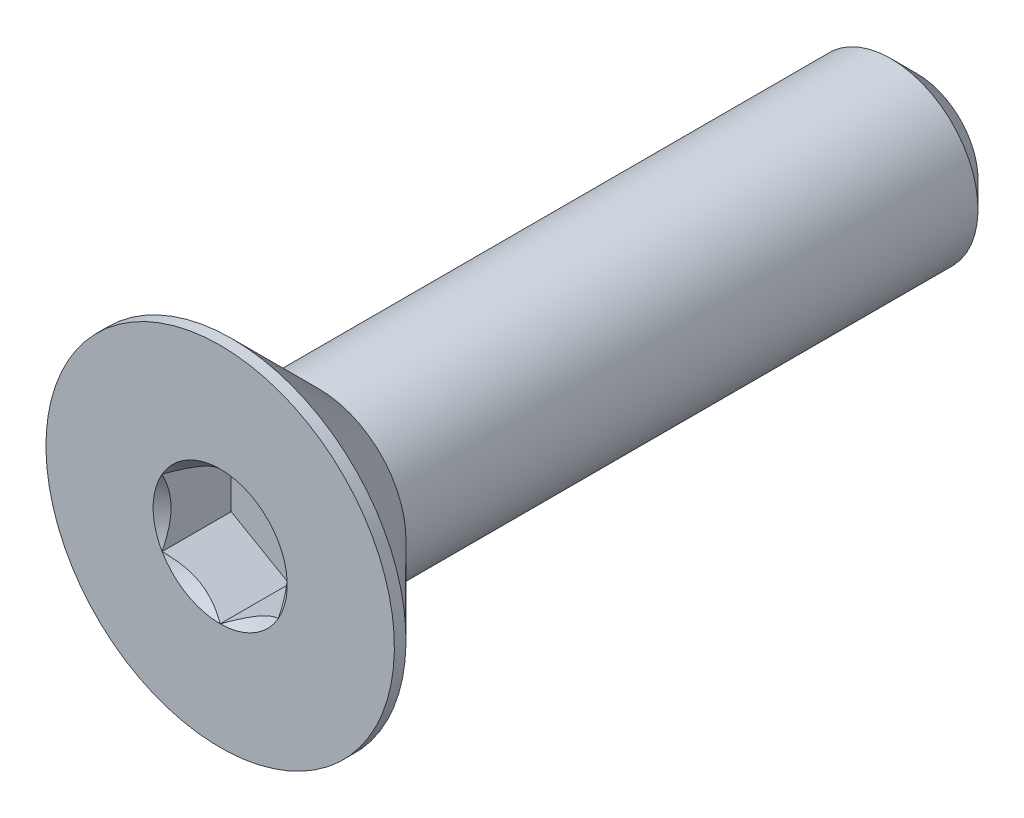
ISO-10303-21;
HEADER;
FILE_DESCRIPTION(('STEP AP214'),'2;1');
FILE_NAME('part.step','',(''),(''),'','','');
FILE_SCHEMA(('AUTOMOTIVE_DESIGN { 1 0 10303 214 1 1 1 1 }'));
ENDSEC;
DATA;
#1=APPLICATION_CONTEXT('core data for automotive mechanical design processes');
#2=APPLICATION_PROTOCOL_DEFINITION('international standard','automotive_design',2000,#1);
#3=PRODUCT_CONTEXT('',#1,'mechanical');
#4=PRODUCT('Part','Part','',(#3));
#5=PRODUCT_RELATED_PRODUCT_CATEGORY('part','',(#4));
#6=PRODUCT_DEFINITION_FORMATION('','',#4);
#7=PRODUCT_DEFINITION_CONTEXT('part definition',#1,'design');
#8=PRODUCT_DEFINITION('design','',#6,#7);
#9=PRODUCT_DEFINITION_SHAPE('','',#8);
#10=(LENGTH_UNIT() NAMED_UNIT(*) SI_UNIT(.MILLI.,.METRE.));
#11=(NAMED_UNIT(*) PLANE_ANGLE_UNIT() SI_UNIT($,.RADIAN.));
#12=(NAMED_UNIT(*) SI_UNIT($,.STERADIAN.) SOLID_ANGLE_UNIT());
#13=UNCERTAINTY_MEASURE_WITH_UNIT(LENGTH_MEASURE(1.E-05),#10,'distance_accuracy_value','');
#14=(GEOMETRIC_REPRESENTATION_CONTEXT(3) GLOBAL_UNCERTAINTY_ASSIGNED_CONTEXT((#13)) GLOBAL_UNIT_ASSIGNED_CONTEXT((#10,
#11,#12)) REPRESENTATION_CONTEXT('',''));
#15=CARTESIAN_POINT('',(0.,0.,0.));
#16=DIRECTION('',(0.,0.,1.));
#17=DIRECTION('',(1.,0.,0.));
#18=AXIS2_PLACEMENT_3D('',#15,#16,#17);
#19=CARTESIAN_POINT('',(0.,0.,-6.));
#20=DIRECTION('',(0.,0.,-1.));
#21=DIRECTION('',(0.,1.,0.));
#22=AXIS2_PLACEMENT_3D('',#19,#20,#21);
#23=CYLINDRICAL_SURFACE('',#22,1.5);
#24=CARTESIAN_POINT('',(0.,0.,4.3));
#25=DIRECTION('',(0.,0.,-1.));
#26=DIRECTION('',(0.,1.,0.));
#27=AXIS2_PLACEMENT_3D('',#24,#25,#26);
#28=CIRCLE('',#27,1.5);
#29=CARTESIAN_POINT('',(0.,1.5,4.3));
#30=VERTEX_POINT('',#29);
#31=EDGE_CURVE('E11',#30,#30,#28,.F.);
#32=ORIENTED_EDGE('',*,*,#31,.F.);
#33=EDGE_LOOP('',(#32));
#34=FACE_BOUND('',#33,.T.);
#35=CARTESIAN_POINT('',(0.,0.,-5.55));
#36=DIRECTION('',(0.,0.,-1.));
#37=DIRECTION('',(0.,1.,0.));
#38=AXIS2_PLACEMENT_3D('',#35,#36,#37);
#39=CIRCLE('',#38,1.5);
#40=CARTESIAN_POINT('',(0.,1.5,-5.55));
#41=VERTEX_POINT('',#40);
#42=EDGE_CURVE('E47',#41,#41,#39,.F.);
#43=ORIENTED_EDGE('',*,*,#42,.T.);
#44=EDGE_LOOP('',(#43));
#45=FACE_BOUND('',#44,.T.);
#46=ADVANCED_FACE('F39',(#34,#45),#23,.T.);
#47=CARTESIAN_POINT('',(0.,1.5,-6.));
#48=DIRECTION('',(0.,0.,-1.));
#49=DIRECTION('',(0.,1.,0.));
#50=AXIS2_PLACEMENT_3D('',#47,#48,#49);
#51=PLANE('',#50);
#52=CARTESIAN_POINT('',(0.,0.,-6.));
#53=DIRECTION('',(0.,0.,-1.));
#54=DIRECTION('',(0.,1.,0.));
#55=AXIS2_PLACEMENT_3D('',#52,#53,#54);
#56=CIRCLE('',#55,1.05);
#57=CARTESIAN_POINT('',(0.,1.05,-6.));
#58=VERTEX_POINT('',#57);
#59=EDGE_CURVE('E151',#58,#58,#56,.T.);
#60=ORIENTED_EDGE('',*,*,#59,.T.);
#61=EDGE_LOOP('',(#60));
#62=FACE_BOUND('',#61,.T.);
#63=ADVANCED_FACE('F160',(#62),#51,.T.);
#64=CARTESIAN_POINT('',(0.,0.,-6.));
#65=DIRECTION('',(0.,0.,1.));
#66=DIRECTION('',(0.,-1.,0.));
#67=AXIS2_PLACEMENT_3D('',#64,#65,#66);
#68=CONICAL_SURFACE('',#67,1.05,0.785398163397447);
#69=ORIENTED_EDGE('',*,*,#42,.F.);
#70=EDGE_LOOP('',(#69));
#71=FACE_BOUND('',#70,.T.);
#72=ORIENTED_EDGE('',*,*,#59,.F.);
#73=EDGE_LOOP('',(#72));
#74=FACE_BOUND('',#73,.T.);
#75=ADVANCED_FACE('F41',(#71,#74),#68,.T.);
#76=CARTESIAN_POINT('',(0.,0.,-6.));
#77=DIRECTION('',(0.,0.,-1.));
#78=DIRECTION('',(0.,1.,0.));
#79=AXIS2_PLACEMENT_3D('',#76,#77,#78);
#80=CYLINDRICAL_SURFACE('',#79,3.);
#81=CARTESIAN_POINT('',(0.,0.,6.));
#82=DIRECTION('',(0.,0.,-1.));
#83=DIRECTION('',(0.,1.,0.));
#84=AXIS2_PLACEMENT_3D('',#81,#82,#83);
#85=CIRCLE('',#84,3.);
#86=CARTESIAN_POINT('',(0.,3.,6.));
#87=VERTEX_POINT('',#86);
#88=EDGE_CURVE('E131',#87,#87,#85,.T.);
#89=ORIENTED_EDGE('',*,*,#88,.T.);
#90=EDGE_LOOP('',(#89));
#91=FACE_BOUND('',#90,.T.);
#92=CARTESIAN_POINT('',(0.,0.,5.8));
#93=DIRECTION('',(0.,0.,-1.));
#94=DIRECTION('',(0.,1.,0.));
#95=AXIS2_PLACEMENT_3D('',#92,#93,#94);
#96=CIRCLE('',#95,3.);
#97=CARTESIAN_POINT('',(0.,3.,5.8));
#98=VERTEX_POINT('',#97);
#99=EDGE_CURVE('E128',#98,#98,#96,.T.);
#100=ORIENTED_EDGE('',*,*,#99,.F.);
#101=EDGE_LOOP('',(#100));
#102=FACE_BOUND('',#101,.T.);
#103=ADVANCED_FACE('F159',(#91,#102),#80,.T.);
#104=CARTESIAN_POINT('',(0.,0.,4.3));
#105=DIRECTION('',(0.,0.,1.));
#106=DIRECTION('',(0.,-1.,0.));
#107=AXIS2_PLACEMENT_3D('',#104,#105,#106);
#108=CONICAL_SURFACE('',#107,1.5,0.785398163397449);
#109=ORIENTED_EDGE('',*,*,#99,.T.);
#110=EDGE_LOOP('',(#109));
#111=FACE_BOUND('',#110,.T.);
#112=ORIENTED_EDGE('',*,*,#31,.T.);
#113=EDGE_LOOP('',(#112));
#114=FACE_BOUND('',#113,.T.);
#115=ADVANCED_FACE('F173',(#111,#114),#108,.T.);
#116=CARTESIAN_POINT('',(0.,0.,6.));
#117=DIRECTION('',(0.,0.,1.));
#118=DIRECTION('',(0.,-1.,0.));
#119=AXIS2_PLACEMENT_3D('',#116,#117,#118);
#120=PLANE('',#119);
#121=CARTESIAN_POINT('',(0.,0.,6.));
#122=DIRECTION('',(0.,0.,1.));
#123=DIRECTION('',(1.,0.,0.));
#124=AXIS2_PLACEMENT_3D('',#121,#122,#123);
#125=CIRCLE('',#124,1.15470053837925);
#126=CARTESIAN_POINT('',(1.,0.577350269189631,6.));
#127=VERTEX_POINT('',#126);
#128=CARTESIAN_POINT('',(0.,1.15470053837926,6.));
#129=VERTEX_POINT('',#128);
#130=EDGE_CURVE('E98',#127,#129,#125,.T.);
#131=ORIENTED_EDGE('',*,*,#130,.F.);
#132=CARTESIAN_POINT('',(0.,0.,6.));
#133=DIRECTION('',(0.,0.,1.));
#134=DIRECTION('',(1.,0.,0.));
#135=AXIS2_PLACEMENT_3D('',#132,#133,#134);
#136=CIRCLE('',#135,1.15470053837925);
#137=CARTESIAN_POINT('',(0.999999999999989,-0.577350269189633,6.));
#138=VERTEX_POINT('',#137);
#139=EDGE_CURVE('E110',#138,#127,#136,.T.);
#140=ORIENTED_EDGE('',*,*,#139,.F.);
#141=CARTESIAN_POINT('',(0.,0.,6.));
#142=DIRECTION('',(0.,0.,1.));
#143=DIRECTION('',(1.,0.,0.));
#144=AXIS2_PLACEMENT_3D('',#141,#142,#143);
#145=CIRCLE('',#144,1.15470053837925);
#146=CARTESIAN_POINT('',(0.,-1.15470053837924,6.));
#147=VERTEX_POINT('',#146);
#148=EDGE_CURVE('E244',#147,#138,#145,.T.);
#149=ORIENTED_EDGE('',*,*,#148,.F.);
#150=CARTESIAN_POINT('',(0.,0.,6.));
#151=DIRECTION('',(0.,0.,1.));
#152=DIRECTION('',(1.,0.,0.));
#153=AXIS2_PLACEMENT_3D('',#150,#151,#152);
#154=CIRCLE('',#153,1.15470053837925);
#155=CARTESIAN_POINT('',(-1.,-0.577350269189613,6.));
#156=VERTEX_POINT('',#155);
#157=EDGE_CURVE('E123',#156,#147,#154,.T.);
#158=ORIENTED_EDGE('',*,*,#157,.F.);
#159=CARTESIAN_POINT('',(0.,0.,6.));
#160=DIRECTION('',(0.,0.,1.));
#161=DIRECTION('',(1.,0.,0.));
#162=AXIS2_PLACEMENT_3D('',#159,#160,#161);
#163=CIRCLE('',#162,1.15470053837925);
#164=CARTESIAN_POINT('',(-1.,0.577350269189624,6.));
#165=VERTEX_POINT('',#164);
#166=EDGE_CURVE('E245',#165,#156,#163,.T.);
#167=ORIENTED_EDGE('',*,*,#166,.F.);
#168=CARTESIAN_POINT('',(0.,0.,6.));
#169=DIRECTION('',(0.,0.,1.));
#170=DIRECTION('',(1.,0.,0.));
#171=AXIS2_PLACEMENT_3D('',#168,#169,#170);
#172=CIRCLE('',#171,1.15470053837925);
#173=EDGE_CURVE('E113',#129,#165,#172,.T.);
#174=ORIENTED_EDGE('',*,*,#173,.F.);
#175=EDGE_LOOP('',(#131,#140,#149,#158,#167,#174));
#176=FACE_BOUND('',#175,.T.);
#177=ORIENTED_EDGE('',*,*,#88,.F.);
#178=EDGE_LOOP('',(#177));
#179=FACE_BOUND('',#178,.T.);
#180=ADVANCED_FACE('F107',(#176,#179),#120,.T.);
#181=CARTESIAN_POINT('',(1.,0.577350269189626,4.81));
#182=DIRECTION('',(0.5,0.866025403784438,0.));
#183=DIRECTION('',(-0.866025403784439,0.5,0.));
#184=AXIS2_PLACEMENT_3D('',#181,#182,#183);
#185=PLANE('',#184);
#186=DIRECTION('',(0.,0.,1.));
#187=VECTOR('',#186,1.);
#188=CARTESIAN_POINT('',(1.,0.577350269189626,4.81));
#189=LINE('',#188,#187);
#190=CARTESIAN_POINT('',(1.,0.577350269189626,4.81));
#191=VERTEX_POINT('',#190);
#192=EDGE_CURVE('E54',#191,#127,#189,.T.);
#193=ORIENTED_EDGE('',*,*,#192,.T.);
#194=CARTESIAN_POINT('',(-0.000199999999999771,1.15481600843309,6.00011548737261));
#195=CARTESIAN_POINT('',(0.0341825950071809,1.13496520795026,5.98027793082573));
#196=CARTESIAN_POINT('',(0.069140118139825,1.11478247255942,5.96160502063888));
#197=CARTESIAN_POINT('',(0.140422802956089,1.07362739529219,5.92741474272315));
#198=CARTESIAN_POINT('',(0.176754750528984,1.0526511355808,5.91191640902345));
#199=CARTESIAN_POINT('',(0.25001661380331,1.01035337909803,5.88536730714226));
#200=CARTESIAN_POINT('',(0.286927851445413,0.989042666109242,5.87424977399692));
#201=CARTESIAN_POINT('',(0.361562729310858,0.945952199282693,5.85711986577618));
#202=CARTESIAN_POINT('',(0.399284088108634,0.924173762626598,5.85109469746667));
#203=CARTESIAN_POINT('',(0.464292198417931,0.886641312640016,5.84566055496749));
#204=CARTESIAN_POINT('',(0.49149437152817,0.870936130672277,5.84485693831673));
#205=CARTESIAN_POINT('',(0.545846040669109,0.83955617986285,5.84620669941688));
#206=CARTESIAN_POINT('',(0.572995523754873,0.823881418494926,5.84836072954719));
#207=CARTESIAN_POINT('',(0.654056277326957,0.777080970599369,5.85911697212847));
#208=CARTESIAN_POINT('',(0.707564140978424,0.746188191116433,5.87201455641535));
#209=CARTESIAN_POINT('',(0.801476065143428,0.691968116419652,5.90314073060217));
#210=CARTESIAN_POINT('',(0.842320523671831,0.668386557293374,5.91973779770184));
#211=CARTESIAN_POINT('',(0.922409637381942,0.622147085933683,5.95712492468529));
#212=CARTESIAN_POINT('',(0.961659010870436,0.599486449584576,5.9779013418174));
#213=CARTESIAN_POINT('',(1.0002,0.577234799135789,6.00011548737261));
#214=B_SPLINE_CURVE_WITH_KNOTS('',3,(#194,#195,#196,#197,#198,#199,#200,#201,#202,#203,#204,
#205,#206,#207,#208,#209,#210,#211,#212,#213),.UNSPECIFIED.,.F.,.F.,(4,2,2,2,2,2,2,2,2,4),(0.,
0.133237676828559,0.267252229834489,0.399137076269298,0.530689603280766,0.624814864263843,
0.718960890149129,0.907306626112092,1.05710100361789,1.20641411519286),.UNSPECIFIED.);
#215=EDGE_CURVE('E95',#129,#127,#214,.T.);
#216=ORIENTED_EDGE('',*,*,#215,.F.);
#217=DIRECTION('',(0.,0.,1.));
#218=VECTOR('',#217,1.);
#219=CARTESIAN_POINT('',(0.,1.15470053837925,4.81));
#220=LINE('',#219,#218);
#221=CARTESIAN_POINT('',(0.,1.15470053837925,4.81));
#222=VERTEX_POINT('',#221);
#223=EDGE_CURVE('E147',#222,#129,#220,.T.);
#224=ORIENTED_EDGE('',*,*,#223,.F.);
#225=DIRECTION('',(-0.866025403784439,0.5,0.));
#226=VECTOR('',#225,1.);
#227=CARTESIAN_POINT('',(1.,0.577350269189626,4.81));
#228=LINE('',#227,#226);
#229=EDGE_CURVE('E120',#191,#222,#228,.T.);
#230=ORIENTED_EDGE('',*,*,#229,.F.);
#231=EDGE_LOOP('',(#193,#216,#224,#230));
#232=FACE_BOUND('',#231,.T.);
#233=ADVANCED_FACE('F125',(#232),#185,.F.);
#234=CARTESIAN_POINT('',(1.,-0.577350269189627,4.81));
#235=DIRECTION('',(1.,0.,0.));
#236=DIRECTION('',(0.,0.,-1.));
#237=AXIS2_PLACEMENT_3D('',#234,#235,#236);
#238=PLANE('',#237);
#239=DIRECTION('',(0.,0.,1.));
#240=VECTOR('',#239,1.);
#241=CARTESIAN_POINT('',(1.,-0.577350269189627,4.81));
#242=LINE('',#241,#240);
#243=CARTESIAN_POINT('',(1.,-0.577350269189627,4.81));
#244=VERTEX_POINT('',#243);
#245=EDGE_CURVE('E62',#244,#138,#242,.T.);
#246=ORIENTED_EDGE('',*,*,#245,.T.);
#247=CARTESIAN_POINT('',(1.,-1.15147208646462,6.37038567751387));
#248=CARTESIAN_POINT('',(1.,-1.12343447988553,6.34921991987372));
#249=CARTESIAN_POINT('',(1.,-1.09524064850698,6.32826169217592));
#250=CARTESIAN_POINT('',(1.,-1.03847715644377,6.28684602223563));
#251=CARTESIAN_POINT('',(1.,-1.00990740382976,6.26638870612367));
#252=CARTESIAN_POINT('',(1.,-0.923120894333481,6.20560479495452));
#253=CARTESIAN_POINT('',(1.,-0.864253173759063,6.16619222896141));
#254=CARTESIAN_POINT('',(1.,-0.740809858258048,6.08882066420021));
#255=CARTESIAN_POINT('',(1.,-0.676100255137808,6.05107303911435));
#256=CARTESIAN_POINT('',(1.,-0.543448939049124,5.9820245875513));
#257=CARTESIAN_POINT('',(1.,-0.475519112027778,5.95070202784687));
#258=CARTESIAN_POINT('',(1.,-0.373555850333527,5.9123817788838));
#259=CARTESIAN_POINT('',(1.,-0.341031989670906,5.90138359164216));
#260=CARTESIAN_POINT('',(1.,-0.27519907905229,5.88199834214736));
#261=CARTESIAN_POINT('',(1.,-0.24188997517393,5.8736114597767));
#262=CARTESIAN_POINT('',(1.,-0.175247517042989,5.86002522071902));
#263=CARTESIAN_POINT('',(1.,-0.141925568218171,5.85477079076797));
#264=CARTESIAN_POINT('',(1.,-0.0749144362322751,5.84754868657089));
#265=CARTESIAN_POINT('',(1.,-0.0412251978501576,5.84558151361051));
#266=CARTESIAN_POINT('',(1.,0.0249580992634257,5.84508319839316));
#267=CARTESIAN_POINT('',(1.,0.0574512826460443,5.84643026788863));
#268=CARTESIAN_POINT('',(1.,0.122148505701872,5.85221648449898));
#269=CARTESIAN_POINT('',(1.,0.154352610132932,5.85665492066154));
#270=CARTESIAN_POINT('',(1.,0.218799898867646,5.8684568301452));
#271=CARTESIAN_POINT('',(1.,0.25103374326896,5.87587054103851));
#272=CARTESIAN_POINT('',(1.,0.314797132354925,5.89322894249868));
#273=CARTESIAN_POINT('',(1.,0.346326735731011,5.90317342128883));
#274=CARTESIAN_POINT('',(1.,0.445594187730212,5.93822348255434));
#275=CARTESIAN_POINT('',(1.,0.511919139476043,5.96732085835672));
#276=CARTESIAN_POINT('',(1.,0.641453244657538,6.0320153296865));
#277=CARTESIAN_POINT('',(1.,0.70465013312635,6.06763577671524));
#278=CARTESIAN_POINT('',(1.,0.825428490174992,6.14112390134693));
#279=CARTESIAN_POINT('',(1.,0.88313294786769,6.17879194713546));
#280=CARTESIAN_POINT('',(1.,0.96814885370457,6.23702285294316));
#281=CARTESIAN_POINT('',(1.,0.996120570380289,6.25663847576285));
#282=CARTESIAN_POINT('',(1.,1.05168177729902,6.29638851706127));
#283=CARTESIAN_POINT('',(1.,1.07927136997701,6.31652279219883));
#284=CARTESIAN_POINT('',(1.,1.1067018534633,6.33687211907297));
#285=B_SPLINE_CURVE_WITH_KNOTS('',3,(#247,#248,#249,#250,#251,#252,#253,#254,#255,#256,#257,
#258,#259,#260,#261,#262,#263,#264,#265,#266,#267,#268,#269,#270,#271,#272,#273,#274,#275,#276,
#277,#278,#279,#280,#281,#282,#283,#284),.UNSPECIFIED.,.F.,.F.,(4,2,2,2,2,2,2,2,2,2,2,2,2,2,2,2,
2,2,4),(0.,0.105386459083292,0.210799187330127,0.423233611565474,0.647793540908512,
0.871580877738622,0.974493074181434,1.07741235827203,1.17846428203206,1.27953161415764,
1.37694086739612,1.47432772585409,1.57343322804295,1.67253043972853,1.88917353996829,
2.10660791038814,2.31323734249845,2.41572589232046,2.51818641476504),.UNSPECIFIED.);
#286=EDGE_CURVE('E119',#127,#138,#285,.F.);
#287=ORIENTED_EDGE('',*,*,#286,.F.);
#288=ORIENTED_EDGE('',*,*,#192,.F.);
#289=DIRECTION('',(0.,1.,0.));
#290=VECTOR('',#289,1.);
#291=CARTESIAN_POINT('',(1.,-0.577350269189627,4.81));
#292=LINE('',#291,#290);
#293=EDGE_CURVE('E136',#244,#191,#292,.T.);
#294=ORIENTED_EDGE('',*,*,#293,.F.);
#295=EDGE_LOOP('',(#246,#287,#288,#294));
#296=FACE_BOUND('',#295,.T.);
#297=ADVANCED_FACE('F122',(#296),#238,.F.);
#298=CARTESIAN_POINT('',(0.,-1.15470053837925,4.81));
#299=DIRECTION('',(0.5,-0.866025403784439,0.));
#300=DIRECTION('',(0.866025403784439,0.5,0.));
#301=AXIS2_PLACEMENT_3D('',#298,#299,#300);
#302=PLANE('',#301);
#303=DIRECTION('',(0.,0.,1.));
#304=VECTOR('',#303,1.);
#305=CARTESIAN_POINT('',(0.,-1.15470053837925,4.81));
#306=LINE('',#305,#304);
#307=CARTESIAN_POINT('',(0.,-1.15470053837925,4.81));
#308=VERTEX_POINT('',#307);
#309=EDGE_CURVE('E133',#308,#147,#306,.T.);
#310=ORIENTED_EDGE('',*,*,#309,.T.);
#311=CARTESIAN_POINT('',(1.0002,-0.577234799135789,6.00011548737262));
#312=CARTESIAN_POINT('',(0.965817404992819,-0.597085599618622,5.98027793082574));
#313=CARTESIAN_POINT('',(0.930859881860175,-0.617268335009457,5.9616050206389));
#314=CARTESIAN_POINT('',(0.859577197043911,-0.658423412276686,5.92741474272317));
#315=CARTESIAN_POINT('',(0.823245249471016,-0.67939967198808,5.91191640902347));
#316=CARTESIAN_POINT('',(0.74998338619669,-0.721697428470846,5.88536730714227));
#317=CARTESIAN_POINT('',(0.713072148554587,-0.743008141459636,5.87424977399693));
#318=CARTESIAN_POINT('',(0.638437270689143,-0.786098608286185,5.85711986577619));
#319=CARTESIAN_POINT('',(0.600715911891367,-0.80787704494228,5.85109469746668));
#320=CARTESIAN_POINT('',(0.535707801582069,-0.845409494928862,5.8456605549675));
#321=CARTESIAN_POINT('',(0.50850562847183,-0.861114676896601,5.84485693831674));
#322=CARTESIAN_POINT('',(0.45415395933089,-0.892494627706028,5.8462066994169));
#323=CARTESIAN_POINT('',(0.427004476245126,-0.908169389073953,5.84836072954721));
#324=CARTESIAN_POINT('',(0.345943722673041,-0.95496983696951,5.85911697212848));
#325=CARTESIAN_POINT('',(0.292435859021574,-0.985862616452447,5.87201455641537));
#326=CARTESIAN_POINT('',(0.198523934856569,-1.04008269114923,5.90314073060219));
#327=CARTESIAN_POINT('',(0.157679476328166,-1.06366425027551,5.91973779770185));
#328=CARTESIAN_POINT('',(0.0775903626180564,-1.1099037216352,5.9571249246853));
#329=CARTESIAN_POINT('',(0.0383409891295622,-1.1325643579843,5.97790134181741));
#330=CARTESIAN_POINT('',(-0.000199999999999974,-1.15481600843309,6.00011548737262));
#331=B_SPLINE_CURVE_WITH_KNOTS('',3,(#311,#312,#313,#314,#315,#316,#317,#318,#319,#320,#321,
#322,#323,#324,#325,#326,#327,#328,#329,#330),.UNSPECIFIED.,.F.,.F.,(4,2,2,2,2,2,2,2,2,4),(0.,
0.133237676828558,0.267252229834488,0.399137076269296,0.530689603280763,0.624814864263842,
0.718960890149129,0.907306626112095,1.05710100361789,1.20641411519286),.UNSPECIFIED.);
#332=EDGE_CURVE('E242',#138,#147,#331,.T.);
#333=ORIENTED_EDGE('',*,*,#332,.F.);
#334=ORIENTED_EDGE('',*,*,#245,.F.);
#335=DIRECTION('',(0.866025403784439,0.5,0.));
#336=VECTOR('',#335,1.);
#337=CARTESIAN_POINT('',(0.,-1.15470053837925,4.81));
#338=LINE('',#337,#336);
#339=EDGE_CURVE('E234',#308,#244,#338,.T.);
#340=ORIENTED_EDGE('',*,*,#339,.F.);
#341=EDGE_LOOP('',(#310,#333,#334,#340));
#342=FACE_BOUND('',#341,.T.);
#343=ADVANCED_FACE('F199',(#342),#302,.F.);
#344=CARTESIAN_POINT('',(-1.,-0.577350269189626,4.81));
#345=DIRECTION('',(-0.5,-0.866025403784439,0.));
#346=DIRECTION('',(0.866025403784439,-0.5,0.));
#347=AXIS2_PLACEMENT_3D('',#344,#345,#346);
#348=PLANE('',#347);
#349=DIRECTION('',(0.,0.,1.));
#350=VECTOR('',#349,1.);
#351=CARTESIAN_POINT('',(-1.,-0.577350269189626,4.81));
#352=LINE('',#351,#350);
#353=CARTESIAN_POINT('',(-1.,-0.577350269189626,4.81));
#354=VERTEX_POINT('',#353);
#355=EDGE_CURVE('E141',#354,#156,#352,.T.);
#356=ORIENTED_EDGE('',*,*,#355,.T.);
#357=CARTESIAN_POINT('',(0.000199999999999887,-1.15481600843309,6.00011548737262));
#358=CARTESIAN_POINT('',(-0.0341825950071809,-1.13496520795026,5.98027793082574));
#359=CARTESIAN_POINT('',(-0.0691401181398252,-1.11478247255942,5.9616050206389));
#360=CARTESIAN_POINT('',(-0.14042280295609,-1.07362739529219,5.92741474272317));
#361=CARTESIAN_POINT('',(-0.176754750528985,-1.0526511355808,5.91191640902347));
#362=CARTESIAN_POINT('',(-0.250016613803312,-1.01035337909803,5.88536730714227));
#363=CARTESIAN_POINT('',(-0.286927851445416,-0.98904266610924,5.87424977399694));
#364=CARTESIAN_POINT('',(-0.361562729310861,-0.94595219928269,5.85711986577619));
#365=CARTESIAN_POINT('',(-0.399284088108638,-0.924173762626595,5.85109469746668));
#366=CARTESIAN_POINT('',(-0.464292198417936,-0.886641312640013,5.8456605549675));
#367=CARTESIAN_POINT('',(-0.491494371528175,-0.870936130672274,5.84485693831674));
#368=CARTESIAN_POINT('',(-0.545846040669115,-0.839556179862847,5.8462066994169));
#369=CARTESIAN_POINT('',(-0.572995523754879,-0.823881418494922,5.84836072954721));
#370=CARTESIAN_POINT('',(-0.654056277326964,-0.777080970599364,5.85911697212848));
#371=CARTESIAN_POINT('',(-0.707564140978432,-0.746188191116428,5.87201455641537));
#372=CARTESIAN_POINT('',(-0.801476065143435,-0.691968116419647,5.90314073060219));
#373=CARTESIAN_POINT('',(-0.842320523671837,-0.66838655729337,5.91973779770185));
#374=CARTESIAN_POINT('',(-0.922409637381945,-0.622147085933681,5.9571249246853));
#375=CARTESIAN_POINT('',(-0.961659010870438,-0.599486449584575,5.97790134181741));
#376=CARTESIAN_POINT('',(-1.0002,-0.577234799135788,6.00011548737262));
#377=B_SPLINE_CURVE_WITH_KNOTS('',3,(#357,#358,#359,#360,#361,#362,#363,#364,#365,#366,#367,
#368,#369,#370,#371,#372,#373,#374,#375,#376),.UNSPECIFIED.,.F.,.F.,(4,2,2,2,2,2,2,2,2,4),(0.,
0.13323767682856,0.267252229834492,0.399137076269302,0.530689603280771,0.624814864263849,
0.718960890149137,0.907306626112103,1.0571010036179,1.20641411519286),.UNSPECIFIED.);
#378=EDGE_CURVE('E216',#147,#156,#377,.T.);
#379=ORIENTED_EDGE('',*,*,#378,.F.);
#380=ORIENTED_EDGE('',*,*,#309,.F.);
#381=DIRECTION('',(0.866025403784439,-0.5,0.));
#382=VECTOR('',#381,1.);
#383=CARTESIAN_POINT('',(-1.,-0.577350269189626,4.81));
#384=LINE('',#383,#382);
#385=EDGE_CURVE('E232',#354,#308,#384,.T.);
#386=ORIENTED_EDGE('',*,*,#385,.F.);
#387=EDGE_LOOP('',(#356,#379,#380,#386));
#388=FACE_BOUND('',#387,.T.);
#389=ADVANCED_FACE('F195',(#388),#348,.F.);
#390=CARTESIAN_POINT('',(-1.,0.577350269189626,4.81));
#391=DIRECTION('',(-1.,0.,0.));
#392=DIRECTION('',(0.,-1.,0.));
#393=AXIS2_PLACEMENT_3D('',#390,#391,#392);
#394=PLANE('',#393);
#395=DIRECTION('',(0.,0.,1.));
#396=VECTOR('',#395,1.);
#397=CARTESIAN_POINT('',(-1.,0.577350269189626,4.81));
#398=LINE('',#397,#396);
#399=CARTESIAN_POINT('',(-1.,0.577350269189626,4.81));
#400=VERTEX_POINT('',#399);
#401=EDGE_CURVE('E144',#400,#165,#398,.T.);
#402=ORIENTED_EDGE('',*,*,#401,.T.);
#403=CARTESIAN_POINT('',(-1.,-1.15147208646462,6.37038567751387));
#404=CARTESIAN_POINT('',(-1.,-1.12343447988552,6.34921991987372));
#405=CARTESIAN_POINT('',(-1.,-1.09524064850698,6.32826169217592));
#406=CARTESIAN_POINT('',(-1.,-1.03847715644377,6.28684602223563));
#407=CARTESIAN_POINT('',(-1.,-1.00990740382975,6.26638870612367));
#408=CARTESIAN_POINT('',(-1.,-0.923120894333481,6.20560479495452));
#409=CARTESIAN_POINT('',(-1.,-0.864253173759063,6.16619222896141));
#410=CARTESIAN_POINT('',(-1.,-0.740809858258048,6.08882066420021));
#411=CARTESIAN_POINT('',(-1.,-0.676100255137808,6.05107303911435));
#412=CARTESIAN_POINT('',(-1.,-0.543448939049123,5.9820245875513));
#413=CARTESIAN_POINT('',(-1.,-0.475519112027777,5.95070202784687));
#414=CARTESIAN_POINT('',(-1.,-0.373555850333526,5.9123817788838));
#415=CARTESIAN_POINT('',(-1.,-0.341031989670905,5.90138359164216));
#416=CARTESIAN_POINT('',(-1.,-0.27519907905229,5.88199834214736));
#417=CARTESIAN_POINT('',(-1.,-0.241889975173929,5.8736114597767));
#418=CARTESIAN_POINT('',(-1.,-0.175247517042988,5.86002522071902));
#419=CARTESIAN_POINT('',(-1.,-0.141925568218171,5.85477079076797));
#420=CARTESIAN_POINT('',(-1.,-0.0749144362322744,5.84754868657089));
#421=CARTESIAN_POINT('',(-1.,-0.0412251978501569,5.84558151361051));
#422=CARTESIAN_POINT('',(-1.,0.0249580992634262,5.84508319839316));
#423=CARTESIAN_POINT('',(-1.,0.0574512826460446,5.84643026788864));
#424=CARTESIAN_POINT('',(-1.,0.122148505701872,5.85221648449899));
#425=CARTESIAN_POINT('',(-1.,0.154352610132932,5.85665492066154));
#426=CARTESIAN_POINT('',(-1.,0.218799898867646,5.8684568301452));
#427=CARTESIAN_POINT('',(-1.,0.25103374326896,5.87587054103851));
#428=CARTESIAN_POINT('',(-1.,0.314797132354926,5.89322894249868));
#429=CARTESIAN_POINT('',(-1.,0.346326735731011,5.90317342128883));
#430=CARTESIAN_POINT('',(-1.,0.445594187730212,5.93822348255434));
#431=CARTESIAN_POINT('',(-1.,0.511919139476043,5.96732085835673));
#432=CARTESIAN_POINT('',(-1.,0.641453244657539,6.0320153296865));
#433=CARTESIAN_POINT('',(-1.,0.704650133126351,6.06763577671524));
#434=CARTESIAN_POINT('',(-1.,0.825428490174992,6.14112390134694));
#435=CARTESIAN_POINT('',(-1.,0.883132947867691,6.17879194713546));
#436=CARTESIAN_POINT('',(-1.,0.968148853704571,6.23702285294316));
#437=CARTESIAN_POINT('',(-1.,0.99612057038029,6.25663847576286));
#438=CARTESIAN_POINT('',(-1.,1.05168177729902,6.29638851706127));
#439=CARTESIAN_POINT('',(-1.,1.07927136997701,6.31652279219883));
#440=CARTESIAN_POINT('',(-1.,1.1067018534633,6.33687211907297));
#441=B_SPLINE_CURVE_WITH_KNOTS('',3,(#403,#404,#405,#406,#407,#408,#409,#410,#411,#412,#413,
#414,#415,#416,#417,#418,#419,#420,#421,#422,#423,#424,#425,#426,#427,#428,#429,#430,#431,#432,
#433,#434,#435,#436,#437,#438,#439,#440),.UNSPECIFIED.,.F.,.F.,(4,2,2,2,2,2,2,2,2,2,2,2,2,2,2,2,
2,2,4),(0.,0.105386459083291,0.210799187330127,0.423233611565474,0.647793540908512,
0.871580877738622,0.974493074181434,1.07741235827203,1.17846428203206,1.27953161415764,
1.37694086739612,1.47432772585409,1.57343322804295,1.67253043972853,1.88917353996829,
2.10660791038815,2.31323734249845,2.41572589232046,2.51818641476504),.UNSPECIFIED.);
#442=EDGE_CURVE('E101',#156,#165,#441,.T.);
#443=ORIENTED_EDGE('',*,*,#442,.F.);
#444=ORIENTED_EDGE('',*,*,#355,.F.);
#445=DIRECTION('',(0.,-1.,0.));
#446=VECTOR('',#445,1.);
#447=CARTESIAN_POINT('',(-1.,0.577350269189626,4.81));
#448=LINE('',#447,#446);
#449=EDGE_CURVE('E229',#400,#354,#448,.T.);
#450=ORIENTED_EDGE('',*,*,#449,.F.);
#451=EDGE_LOOP('',(#402,#443,#444,#450));
#452=FACE_BOUND('',#451,.T.);
#453=ADVANCED_FACE('F191',(#452),#394,.F.);
#454=CARTESIAN_POINT('',(0.,1.15470053837925,4.81));
#455=DIRECTION('',(-0.5,0.866025403784439,0.));
#456=DIRECTION('',(-0.866025403784439,-0.5,0.));
#457=AXIS2_PLACEMENT_3D('',#454,#455,#456);
#458=PLANE('',#457);
#459=ORIENTED_EDGE('',*,*,#223,.T.);
#460=CARTESIAN_POINT('',(-1.0002,0.577234799135788,6.00011548737261));
#461=CARTESIAN_POINT('',(-0.965817404992819,0.597085599618622,5.98027793082573));
#462=CARTESIAN_POINT('',(-0.930859881860174,0.617268335009457,5.96160502063889));
#463=CARTESIAN_POINT('',(-0.859577197043909,0.658423412276687,5.92741474272315));
#464=CARTESIAN_POINT('',(-0.823245249471015,0.679399671988081,5.91191640902345));
#465=CARTESIAN_POINT('',(-0.749983386196687,0.721697428470848,5.88536730714226));
#466=CARTESIAN_POINT('',(-0.713072148554583,0.743008141459638,5.87424977399692));
#467=CARTESIAN_POINT('',(-0.638437270689138,0.786098608286188,5.85711986577618));
#468=CARTESIAN_POINT('',(-0.600715911891361,0.807877044942283,5.85109469746667));
#469=CARTESIAN_POINT('',(-0.535707801582063,0.845409494928865,5.84566055496749));
#470=CARTESIAN_POINT('',(-0.508505628471824,0.861114676896604,5.84485693831673));
#471=CARTESIAN_POINT('',(-0.454153959330885,0.892494627706031,5.84620669941688));
#472=CARTESIAN_POINT('',(-0.427004476245121,0.908169389073956,5.84836072954719));
#473=CARTESIAN_POINT('',(-0.345943722673037,0.954969836969513,5.85911697212847));
#474=CARTESIAN_POINT('',(-0.29243585902157,0.985862616452449,5.87201455641535));
#475=CARTESIAN_POINT('',(-0.198523934856567,1.04008269114923,5.90314073060217));
#476=CARTESIAN_POINT('',(-0.157679476328164,1.06366425027551,5.91973779770183));
#477=CARTESIAN_POINT('',(-0.0775903626180557,1.1099037216352,5.95712492468529));
#478=CARTESIAN_POINT('',(-0.038340989129562,1.1325643579843,5.9779013418174));
#479=CARTESIAN_POINT('',(0.000200000000000015,1.15481600843309,6.00011548737261));
#480=B_SPLINE_CURVE_WITH_KNOTS('',3,(#460,#461,#462,#463,#464,#465,#466,#467,#468,#469,#470,
#471,#472,#473,#474,#475,#476,#477,#478,#479),.UNSPECIFIED.,.F.,.F.,(4,2,2,2,2,2,2,2,2,4),(0.,
0.133237676828561,0.267252229834493,0.399137076269304,0.530689603280773,0.624814864263851,
0.718960890149137,0.907306626112101,1.0571010036179,1.20641411519286),.UNSPECIFIED.);
#481=EDGE_CURVE('E238',#165,#129,#480,.T.);
#482=ORIENTED_EDGE('',*,*,#481,.F.);
#483=ORIENTED_EDGE('',*,*,#401,.F.);
#484=DIRECTION('',(-0.866025403784439,-0.5,0.));
#485=VECTOR('',#484,1.);
#486=CARTESIAN_POINT('',(0.,1.15470053837925,4.81));
#487=LINE('',#486,#485);
#488=EDGE_CURVE('E226',#222,#400,#487,.T.);
#489=ORIENTED_EDGE('',*,*,#488,.F.);
#490=EDGE_LOOP('',(#459,#482,#483,#489));
#491=FACE_BOUND('',#490,.T.);
#492=ADVANCED_FACE('F187',(#491),#458,.F.);
#493=CARTESIAN_POINT('',(0.,0.,4.81));
#494=DIRECTION('',(0.,0.,1.));
#495=DIRECTION('',(1.,0.,0.));
#496=AXIS2_PLACEMENT_3D('',#493,#494,#495);
#497=PLANE('',#496);
#498=ORIENTED_EDGE('',*,*,#229,.T.);
#499=ORIENTED_EDGE('',*,*,#488,.T.);
#500=ORIENTED_EDGE('',*,*,#449,.T.);
#501=ORIENTED_EDGE('',*,*,#385,.T.);
#502=ORIENTED_EDGE('',*,*,#339,.T.);
#503=ORIENTED_EDGE('',*,*,#293,.T.);
#504=EDGE_LOOP('',(#498,#499,#500,#501,#502,#503));
#505=FACE_BOUND('',#504,.T.);
#506=ADVANCED_FACE('F190',(#505),#497,.T.);
#507=CARTESIAN_POINT('',(0.,0.,6.));
#508=DIRECTION('',(0.,0.,1.));
#509=DIRECTION('',(1.,0.,0.));
#510=AXIS2_PLACEMENT_3D('',#507,#508,#509);
#511=CONICAL_SURFACE('',#510,1.15470053837925,0.78539816339745);
#512=ORIENTED_EDGE('',*,*,#481,.T.);
#513=ORIENTED_EDGE('',*,*,#173,.T.);
#514=EDGE_LOOP('',(#512,#513));
#515=FACE_BOUND('',#514,.T.);
#516=ADVANCED_FACE('F206',(#515),#511,.F.);
#517=CARTESIAN_POINT('',(0.,0.,6.));
#518=DIRECTION('',(0.,0.,1.));
#519=DIRECTION('',(1.,0.,0.));
#520=AXIS2_PLACEMENT_3D('',#517,#518,#519);
#521=CONICAL_SURFACE('',#520,1.15470053837925,0.78539816339745);
#522=ORIENTED_EDGE('',*,*,#378,.T.);
#523=ORIENTED_EDGE('',*,*,#157,.T.);
#524=EDGE_LOOP('',(#522,#523));
#525=FACE_BOUND('',#524,.T.);
#526=ADVANCED_FACE('F208',(#525),#521,.F.);
#527=CARTESIAN_POINT('',(0.,0.,6.));
#528=DIRECTION('',(0.,0.,1.));
#529=DIRECTION('',(1.,0.,0.));
#530=AXIS2_PLACEMENT_3D('',#527,#528,#529);
#531=CONICAL_SURFACE('',#530,1.15470053837925,0.78539816339745);
#532=ORIENTED_EDGE('',*,*,#286,.T.);
#533=ORIENTED_EDGE('',*,*,#139,.T.);
#534=EDGE_LOOP('',(#532,#533));
#535=FACE_BOUND('',#534,.T.);
#536=ADVANCED_FACE('F118',(#535),#531,.F.);
#537=CARTESIAN_POINT('',(0.,0.,6.));
#538=DIRECTION('',(0.,0.,1.));
#539=DIRECTION('',(1.,0.,0.));
#540=AXIS2_PLACEMENT_3D('',#537,#538,#539);
#541=CONICAL_SURFACE('',#540,1.15470053837925,0.78539816339745);
#542=ORIENTED_EDGE('',*,*,#332,.T.);
#543=ORIENTED_EDGE('',*,*,#148,.T.);
#544=EDGE_LOOP('',(#542,#543));
#545=FACE_BOUND('',#544,.T.);
#546=ADVANCED_FACE('F257',(#545),#541,.F.);
#547=CARTESIAN_POINT('',(0.,0.,6.));
#548=DIRECTION('',(0.,0.,1.));
#549=DIRECTION('',(1.,0.,0.));
#550=AXIS2_PLACEMENT_3D('',#547,#548,#549);
#551=CONICAL_SURFACE('',#550,1.15470053837925,0.78539816339745);
#552=ORIENTED_EDGE('',*,*,#442,.T.);
#553=ORIENTED_EDGE('',*,*,#166,.T.);
#554=EDGE_LOOP('',(#552,#553));
#555=FACE_BOUND('',#554,.T.);
#556=ADVANCED_FACE('F262',(#555),#551,.F.);
#557=CARTESIAN_POINT('',(0.,0.,6.));
#558=DIRECTION('',(0.,0.,1.));
#559=DIRECTION('',(1.,0.,0.));
#560=AXIS2_PLACEMENT_3D('',#557,#558,#559);
#561=CONICAL_SURFACE('',#560,1.15470053837925,0.78539816339745);
#562=ORIENTED_EDGE('',*,*,#215,.T.);
#563=ORIENTED_EDGE('',*,*,#130,.T.);
#564=EDGE_LOOP('',(#562,#563));
#565=FACE_BOUND('',#564,.T.);
#566=ADVANCED_FACE('F97',(#565),#561,.F.);
#567=CLOSED_SHELL('',(#46,#63,#75,#103,#115,#180,#233,#297,#343,#389,#453,#492,#506,#516,#526,
#536,#546,#556,#566));
#568=MANIFOLD_SOLID_BREP('B2',#567);
#569=ADVANCED_BREP_SHAPE_REPRESENTATION('',(#18,#568),#14);
#570=SHAPE_DEFINITION_REPRESENTATION(#9,#569);
ENDSEC;
END-ISO-10303-21;
